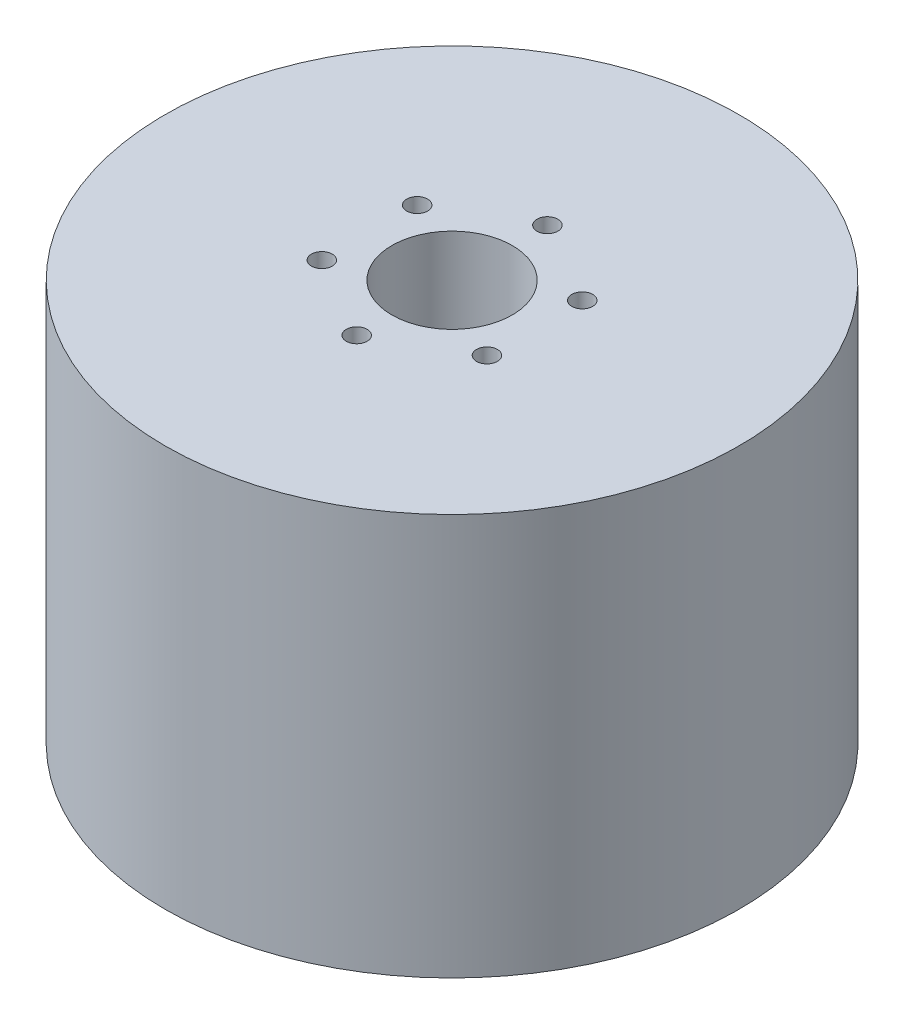
ISO-10303-21;
HEADER;
FILE_DESCRIPTION(('STEP AP214'),'2;1');
FILE_NAME('part.step','',(''),(''),'','','');
FILE_SCHEMA(('AUTOMOTIVE_DESIGN { 1 0 10303 214 1 1 1 1 }'));
ENDSEC;
DATA;
#1=APPLICATION_CONTEXT('core data for automotive mechanical design processes');
#2=APPLICATION_PROTOCOL_DEFINITION('international standard','automotive_design',2000,#1);
#3=PRODUCT_CONTEXT('',#1,'mechanical');
#4=PRODUCT('Part','Part','',(#3));
#5=PRODUCT_RELATED_PRODUCT_CATEGORY('part','',(#4));
#6=PRODUCT_DEFINITION_FORMATION('','',#4);
#7=PRODUCT_DEFINITION_CONTEXT('part definition',#1,'design');
#8=PRODUCT_DEFINITION('design','',#6,#7);
#9=PRODUCT_DEFINITION_SHAPE('','',#8);
#10=(LENGTH_UNIT() NAMED_UNIT(*) SI_UNIT(.MILLI.,.METRE.));
#11=(NAMED_UNIT(*) PLANE_ANGLE_UNIT() SI_UNIT($,.RADIAN.));
#12=(NAMED_UNIT(*) SI_UNIT($,.STERADIAN.) SOLID_ANGLE_UNIT());
#13=UNCERTAINTY_MEASURE_WITH_UNIT(LENGTH_MEASURE(1.E-05),#10,'distance_accuracy_value','');
#14=(GEOMETRIC_REPRESENTATION_CONTEXT(3) GLOBAL_UNCERTAINTY_ASSIGNED_CONTEXT((#13)) GLOBAL_UNIT_ASSIGNED_CONTEXT((#10,
#11,#12)) REPRESENTATION_CONTEXT('',''));
#15=CARTESIAN_POINT('',(0.,0.,0.));
#16=DIRECTION('',(0.,0.,1.));
#17=DIRECTION('',(1.,0.,0.));
#18=AXIS2_PLACEMENT_3D('',#15,#16,#17);
#19=CARTESIAN_POINT('',(0.,100.,0.));
#20=DIRECTION('',(0.,1.,0.));
#21=DIRECTION('',(0.,0.,1.));
#22=AXIS2_PLACEMENT_3D('',#19,#20,#21);
#23=PLANE('',#22);
#24=CARTESIAN_POINT('',(-20.5681033398804,100.,11.875));
#25=DIRECTION('',(0.,1.,0.));
#26=DIRECTION('',(0.,0.,1.));
#27=AXIS2_PLACEMENT_3D('',#24,#25,#26);
#28=CIRCLE('',#27,2.6000000000002);
#29=CARTESIAN_POINT('',(-20.5681033398804,100.,14.4750000000002));
#30=VERTEX_POINT('',#29);
#31=EDGE_CURVE('E81',#30,#30,#28,.T.);
#32=ORIENTED_EDGE('',*,*,#31,.F.);
#33=EDGE_LOOP('',(#32));
#34=FACE_BOUND('',#33,.T.);
#35=CARTESIAN_POINT('',(20.5681033398804,100.,11.875));
#36=DIRECTION('',(0.,1.,0.));
#37=DIRECTION('',(0.,0.,1.));
#38=AXIS2_PLACEMENT_3D('',#35,#36,#37);
#39=CIRCLE('',#38,2.60000000000001);
#40=CARTESIAN_POINT('',(20.5681033398804,100.,14.475));
#41=VERTEX_POINT('',#40);
#42=EDGE_CURVE('E69',#41,#41,#39,.T.);
#43=ORIENTED_EDGE('',*,*,#42,.F.);
#44=EDGE_LOOP('',(#43));
#45=FACE_BOUND('',#44,.T.);
#46=CARTESIAN_POINT('',(0.,100.,-23.75));
#47=DIRECTION('',(0.,1.,0.));
#48=DIRECTION('',(0.,0.,1.));
#49=AXIS2_PLACEMENT_3D('',#46,#47,#48);
#50=CIRCLE('',#49,2.6);
#51=CARTESIAN_POINT('',(0.,100.,-21.15));
#52=VERTEX_POINT('',#51);
#53=EDGE_CURVE('E57',#52,#52,#50,.T.);
#54=ORIENTED_EDGE('',*,*,#53,.F.);
#55=EDGE_LOOP('',(#54));
#56=FACE_BOUND('',#55,.T.);
#57=CARTESIAN_POINT('',(0.,100.,0.));
#58=DIRECTION('',(0.,1.,0.));
#59=DIRECTION('',(0.,0.,1.));
#60=AXIS2_PLACEMENT_3D('',#57,#58,#59);
#61=CIRCLE('',#60,71.5);
#62=CARTESIAN_POINT('',(0.,100.,71.5));
#63=VERTEX_POINT('',#62);
#64=EDGE_CURVE('E10',#63,#63,#61,.T.);
#65=ORIENTED_EDGE('',*,*,#64,.T.);
#66=EDGE_LOOP('',(#65));
#67=FACE_BOUND('',#66,.T.);
#68=CARTESIAN_POINT('',(0.,100.,0.));
#69=DIRECTION('',(0.,1.,0.));
#70=DIRECTION('',(0.,0.,1.));
#71=AXIS2_PLACEMENT_3D('',#68,#69,#70);
#72=CIRCLE('',#71,15.);
#73=CARTESIAN_POINT('',(0.,100.,15.));
#74=VERTEX_POINT('',#73);
#75=EDGE_CURVE('E52',#74,#74,#72,.T.);
#76=ORIENTED_EDGE('',*,*,#75,.F.);
#77=EDGE_LOOP('',(#76));
#78=FACE_BOUND('',#77,.T.);
#79=CARTESIAN_POINT('',(20.5681033398804,100.,-11.875));
#80=DIRECTION('',(0.,1.,0.));
#81=DIRECTION('',(0.,0.,1.));
#82=AXIS2_PLACEMENT_3D('',#79,#80,#81);
#83=CIRCLE('',#82,2.6);
#84=CARTESIAN_POINT('',(20.5681033398804,100.,-9.275));
#85=VERTEX_POINT('',#84);
#86=EDGE_CURVE('E63',#85,#85,#83,.T.);
#87=ORIENTED_EDGE('',*,*,#86,.F.);
#88=EDGE_LOOP('',(#87));
#89=FACE_BOUND('',#88,.T.);
#90=CARTESIAN_POINT('',(0.,100.,23.75));
#91=DIRECTION('',(0.,1.,0.));
#92=DIRECTION('',(0.,0.,1.));
#93=AXIS2_PLACEMENT_3D('',#90,#91,#92);
#94=CIRCLE('',#93,2.60000000000008);
#95=CARTESIAN_POINT('',(0.,100.,26.3500000000001));
#96=VERTEX_POINT('',#95);
#97=EDGE_CURVE('E75',#96,#96,#94,.T.);
#98=ORIENTED_EDGE('',*,*,#97,.F.);
#99=EDGE_LOOP('',(#98));
#100=FACE_BOUND('',#99,.T.);
#101=CARTESIAN_POINT('',(-20.5681033398804,100.,-11.875));
#102=DIRECTION('',(0.,1.,0.));
#103=DIRECTION('',(0.,0.,1.));
#104=AXIS2_PLACEMENT_3D('',#101,#102,#103);
#105=CIRCLE('',#104,2.6);
#106=CARTESIAN_POINT('',(-20.5681033398804,100.,-9.27499999999999));
#107=VERTEX_POINT('',#106);
#108=EDGE_CURVE('E87',#107,#107,#105,.T.);
#109=ORIENTED_EDGE('',*,*,#108,.F.);
#110=EDGE_LOOP('',(#109));
#111=FACE_BOUND('',#110,.T.);
#112=ADVANCED_FACE('F41',(#34,#45,#56,#67,#78,#89,#100,#111),#23,.T.);
#113=CARTESIAN_POINT('',(0.,0.,0.));
#114=DIRECTION('',(0.,1.,0.));
#115=DIRECTION('',(0.,0.,1.));
#116=AXIS2_PLACEMENT_3D('',#113,#114,#115);
#117=PLANE('',#116);
#118=CARTESIAN_POINT('',(0.,0.,0.));
#119=DIRECTION('',(0.,1.,0.));
#120=DIRECTION('',(0.,0.,1.));
#121=AXIS2_PLACEMENT_3D('',#118,#119,#120);
#122=CIRCLE('',#121,71.5);
#123=CARTESIAN_POINT('',(0.,0.,71.5));
#124=VERTEX_POINT('',#123);
#125=EDGE_CURVE('E45',#124,#124,#122,.T.);
#126=ORIENTED_EDGE('',*,*,#125,.F.);
#127=EDGE_LOOP('',(#126));
#128=FACE_BOUND('',#127,.T.);
#129=CARTESIAN_POINT('',(0.,0.,0.));
#130=DIRECTION('',(0.,1.,0.));
#131=DIRECTION('',(0.,0.,1.));
#132=AXIS2_PLACEMENT_3D('',#129,#130,#131);
#133=CIRCLE('',#132,15.);
#134=CARTESIAN_POINT('',(0.,0.,15.));
#135=VERTEX_POINT('',#134);
#136=EDGE_CURVE('E54',#135,#135,#133,.T.);
#137=ORIENTED_EDGE('',*,*,#136,.T.);
#138=EDGE_LOOP('',(#137));
#139=FACE_BOUND('',#138,.T.);
#140=CARTESIAN_POINT('',(0.,0.,-23.75));
#141=DIRECTION('',(0.,1.,0.));
#142=DIRECTION('',(0.,0.,1.));
#143=AXIS2_PLACEMENT_3D('',#140,#141,#142);
#144=CIRCLE('',#143,2.6);
#145=CARTESIAN_POINT('',(0.,0.,-21.15));
#146=VERTEX_POINT('',#145);
#147=EDGE_CURVE('E60',#146,#146,#144,.T.);
#148=ORIENTED_EDGE('',*,*,#147,.T.);
#149=EDGE_LOOP('',(#148));
#150=FACE_BOUND('',#149,.T.);
#151=CARTESIAN_POINT('',(20.5681033398804,0.,-11.875));
#152=DIRECTION('',(0.,1.,0.));
#153=DIRECTION('',(0.,0.,1.));
#154=AXIS2_PLACEMENT_3D('',#151,#152,#153);
#155=CIRCLE('',#154,2.6);
#156=CARTESIAN_POINT('',(20.5681033398804,0.,-9.275));
#157=VERTEX_POINT('',#156);
#158=EDGE_CURVE('E66',#157,#157,#155,.T.);
#159=ORIENTED_EDGE('',*,*,#158,.T.);
#160=EDGE_LOOP('',(#159));
#161=FACE_BOUND('',#160,.T.);
#162=CARTESIAN_POINT('',(20.5681033398804,0.,11.875));
#163=DIRECTION('',(0.,1.,0.));
#164=DIRECTION('',(0.,0.,1.));
#165=AXIS2_PLACEMENT_3D('',#162,#163,#164);
#166=CIRCLE('',#165,2.60000000000001);
#167=CARTESIAN_POINT('',(20.5681033398804,0.,14.475));
#168=VERTEX_POINT('',#167);
#169=EDGE_CURVE('E72',#168,#168,#166,.T.);
#170=ORIENTED_EDGE('',*,*,#169,.T.);
#171=EDGE_LOOP('',(#170));
#172=FACE_BOUND('',#171,.T.);
#173=CARTESIAN_POINT('',(0.,0.,23.75));
#174=DIRECTION('',(0.,1.,0.));
#175=DIRECTION('',(0.,0.,1.));
#176=AXIS2_PLACEMENT_3D('',#173,#174,#175);
#177=CIRCLE('',#176,2.60000000000008);
#178=CARTESIAN_POINT('',(0.,0.,26.3500000000001));
#179=VERTEX_POINT('',#178);
#180=EDGE_CURVE('E78',#179,#179,#177,.T.);
#181=ORIENTED_EDGE('',*,*,#180,.T.);
#182=EDGE_LOOP('',(#181));
#183=FACE_BOUND('',#182,.T.);
#184=CARTESIAN_POINT('',(-20.5681033398804,0.,11.875));
#185=DIRECTION('',(0.,1.,0.));
#186=DIRECTION('',(0.,0.,1.));
#187=AXIS2_PLACEMENT_3D('',#184,#185,#186);
#188=CIRCLE('',#187,2.6000000000002);
#189=CARTESIAN_POINT('',(-20.5681033398804,0.,14.4750000000002));
#190=VERTEX_POINT('',#189);
#191=EDGE_CURVE('E84',#190,#190,#188,.T.);
#192=ORIENTED_EDGE('',*,*,#191,.T.);
#193=EDGE_LOOP('',(#192));
#194=FACE_BOUND('',#193,.T.);
#195=CARTESIAN_POINT('',(-20.5681033398804,0.,-11.875));
#196=DIRECTION('',(0.,1.,0.));
#197=DIRECTION('',(0.,0.,1.));
#198=AXIS2_PLACEMENT_3D('',#195,#196,#197);
#199=CIRCLE('',#198,2.6);
#200=CARTESIAN_POINT('',(-20.5681033398804,0.,-9.27499999999999));
#201=VERTEX_POINT('',#200);
#202=EDGE_CURVE('E90',#201,#201,#199,.T.);
#203=ORIENTED_EDGE('',*,*,#202,.T.);
#204=EDGE_LOOP('',(#203));
#205=FACE_BOUND('',#204,.T.);
#206=ADVANCED_FACE('F100',(#128,#139,#150,#161,#172,#183,#194,#205),#117,.F.);
#207=CARTESIAN_POINT('',(0.,100.,0.));
#208=DIRECTION('',(0.,-1.,0.));
#209=DIRECTION('',(0.,0.,-1.));
#210=AXIS2_PLACEMENT_3D('',#207,#208,#209);
#211=CYLINDRICAL_SURFACE('',#210,71.5);
#212=ORIENTED_EDGE('',*,*,#64,.F.);
#213=EDGE_LOOP('',(#212));
#214=FACE_BOUND('',#213,.T.);
#215=ORIENTED_EDGE('',*,*,#125,.T.);
#216=EDGE_LOOP('',(#215));
#217=FACE_BOUND('',#216,.T.);
#218=ADVANCED_FACE('F43',(#214,#217),#211,.T.);
#219=CARTESIAN_POINT('',(0.,100.,0.));
#220=DIRECTION('',(0.,-1.,0.));
#221=DIRECTION('',(0.,0.,-1.));
#222=AXIS2_PLACEMENT_3D('',#219,#220,#221);
#223=CYLINDRICAL_SURFACE('',#222,15.);
#224=ORIENTED_EDGE('',*,*,#75,.T.);
#225=EDGE_LOOP('',(#224));
#226=FACE_BOUND('',#225,.T.);
#227=ORIENTED_EDGE('',*,*,#136,.F.);
#228=EDGE_LOOP('',(#227));
#229=FACE_BOUND('',#228,.T.);
#230=ADVANCED_FACE('F110',(#226,#229),#223,.F.);
#231=CARTESIAN_POINT('',(0.,100.,-23.75));
#232=DIRECTION('',(0.,-1.,0.));
#233=DIRECTION('',(0.,0.,-1.));
#234=AXIS2_PLACEMENT_3D('',#231,#232,#233);
#235=CYLINDRICAL_SURFACE('',#234,2.6);
#236=ORIENTED_EDGE('',*,*,#53,.T.);
#237=EDGE_LOOP('',(#236));
#238=FACE_BOUND('',#237,.T.);
#239=ORIENTED_EDGE('',*,*,#147,.F.);
#240=EDGE_LOOP('',(#239));
#241=FACE_BOUND('',#240,.T.);
#242=ADVANCED_FACE('F113',(#238,#241),#235,.F.);
#243=CARTESIAN_POINT('',(20.5681033398804,100.,-11.875));
#244=DIRECTION('',(0.,-1.,0.));
#245=DIRECTION('',(0.,0.,-1.));
#246=AXIS2_PLACEMENT_3D('',#243,#244,#245);
#247=CYLINDRICAL_SURFACE('',#246,2.6);
#248=ORIENTED_EDGE('',*,*,#86,.T.);
#249=EDGE_LOOP('',(#248));
#250=FACE_BOUND('',#249,.T.);
#251=ORIENTED_EDGE('',*,*,#158,.F.);
#252=EDGE_LOOP('',(#251));
#253=FACE_BOUND('',#252,.T.);
#254=ADVANCED_FACE('F117',(#250,#253),#247,.F.);
#255=CARTESIAN_POINT('',(20.5681033398804,100.,11.875));
#256=DIRECTION('',(0.,-1.,0.));
#257=DIRECTION('',(0.,0.,-1.));
#258=AXIS2_PLACEMENT_3D('',#255,#256,#257);
#259=CYLINDRICAL_SURFACE('',#258,2.60000000000001);
#260=ORIENTED_EDGE('',*,*,#42,.T.);
#261=EDGE_LOOP('',(#260));
#262=FACE_BOUND('',#261,.T.);
#263=ORIENTED_EDGE('',*,*,#169,.F.);
#264=EDGE_LOOP('',(#263));
#265=FACE_BOUND('',#264,.T.);
#266=ADVANCED_FACE('F121',(#262,#265),#259,.F.);
#267=CARTESIAN_POINT('',(0.,100.,23.75));
#268=DIRECTION('',(0.,-1.,0.));
#269=DIRECTION('',(0.,0.,-1.));
#270=AXIS2_PLACEMENT_3D('',#267,#268,#269);
#271=CYLINDRICAL_SURFACE('',#270,2.60000000000008);
#272=ORIENTED_EDGE('',*,*,#97,.T.);
#273=EDGE_LOOP('',(#272));
#274=FACE_BOUND('',#273,.T.);
#275=ORIENTED_EDGE('',*,*,#180,.F.);
#276=EDGE_LOOP('',(#275));
#277=FACE_BOUND('',#276,.T.);
#278=ADVANCED_FACE('F125',(#274,#277),#271,.F.);
#279=CARTESIAN_POINT('',(-20.5681033398804,100.,11.875));
#280=DIRECTION('',(0.,-1.,0.));
#281=DIRECTION('',(0.,0.,-1.));
#282=AXIS2_PLACEMENT_3D('',#279,#280,#281);
#283=CYLINDRICAL_SURFACE('',#282,2.6000000000002);
#284=ORIENTED_EDGE('',*,*,#31,.T.);
#285=EDGE_LOOP('',(#284));
#286=FACE_BOUND('',#285,.T.);
#287=ORIENTED_EDGE('',*,*,#191,.F.);
#288=EDGE_LOOP('',(#287));
#289=FACE_BOUND('',#288,.T.);
#290=ADVANCED_FACE('F129',(#286,#289),#283,.F.);
#291=CARTESIAN_POINT('',(-20.5681033398804,100.,-11.875));
#292=DIRECTION('',(0.,-1.,0.));
#293=DIRECTION('',(0.,0.,-1.));
#294=AXIS2_PLACEMENT_3D('',#291,#292,#293);
#295=CYLINDRICAL_SURFACE('',#294,2.6);
#296=ORIENTED_EDGE('',*,*,#108,.T.);
#297=EDGE_LOOP('',(#296));
#298=FACE_BOUND('',#297,.T.);
#299=ORIENTED_EDGE('',*,*,#202,.F.);
#300=EDGE_LOOP('',(#299));
#301=FACE_BOUND('',#300,.T.);
#302=ADVANCED_FACE('F96',(#298,#301),#295,.F.);
#303=CLOSED_SHELL('',(#112,#206,#218,#230,#242,#254,#266,#278,#290,#302));
#304=MANIFOLD_SOLID_BREP('B2',#303);
#305=ADVANCED_BREP_SHAPE_REPRESENTATION('',(#18,#304),#14);
#306=SHAPE_DEFINITION_REPRESENTATION(#9,#305);
ENDSEC;
END-ISO-10303-21;
